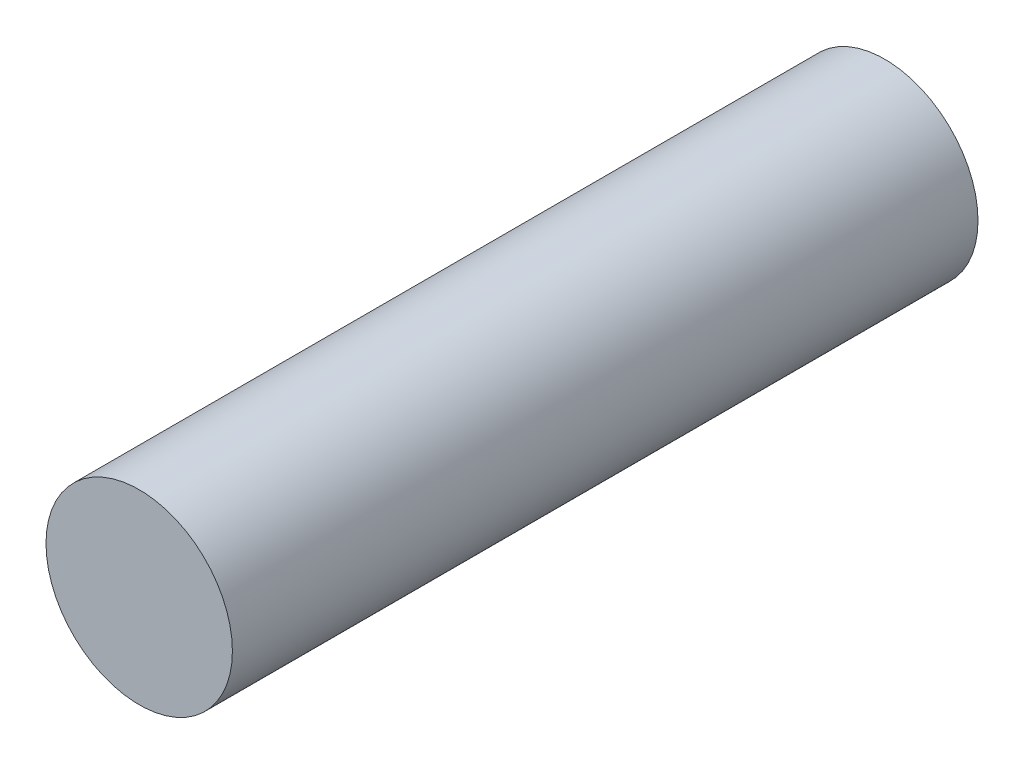
ISO-10303-21;
HEADER;
FILE_DESCRIPTION(('STEP AP214'),'2;1');
FILE_NAME('part.step','',(''),(''),'','','');
FILE_SCHEMA(('AUTOMOTIVE_DESIGN { 1 0 10303 214 1 1 1 1 }'));
ENDSEC;
DATA;
#1=APPLICATION_CONTEXT('core data for automotive mechanical design processes');
#2=APPLICATION_PROTOCOL_DEFINITION('international standard','automotive_design',2000,#1);
#3=PRODUCT_CONTEXT('',#1,'mechanical');
#4=PRODUCT('Part','Part','',(#3));
#5=PRODUCT_RELATED_PRODUCT_CATEGORY('part','',(#4));
#6=PRODUCT_DEFINITION_FORMATION('','',#4);
#7=PRODUCT_DEFINITION_CONTEXT('part definition',#1,'design');
#8=PRODUCT_DEFINITION('design','',#6,#7);
#9=PRODUCT_DEFINITION_SHAPE('','',#8);
#10=(LENGTH_UNIT() NAMED_UNIT(*) SI_UNIT(.MILLI.,.METRE.));
#11=(NAMED_UNIT(*) PLANE_ANGLE_UNIT() SI_UNIT($,.RADIAN.));
#12=(NAMED_UNIT(*) SI_UNIT($,.STERADIAN.) SOLID_ANGLE_UNIT());
#13=UNCERTAINTY_MEASURE_WITH_UNIT(LENGTH_MEASURE(1.E-05),#10,'distance_accuracy_value','');
#14=(GEOMETRIC_REPRESENTATION_CONTEXT(3) GLOBAL_UNCERTAINTY_ASSIGNED_CONTEXT((#13)) GLOBAL_UNIT_ASSIGNED_CONTEXT((#10,
#11,#12)) REPRESENTATION_CONTEXT('',''));
#15=CARTESIAN_POINT('',(0.,0.,0.));
#16=DIRECTION('',(0.,0.,1.));
#17=DIRECTION('',(1.,0.,0.));
#18=AXIS2_PLACEMENT_3D('',#15,#16,#17);
#19=CARTESIAN_POINT('',(0.,0.,19.05));
#20=DIRECTION('',(0.,0.,-1.));
#21=DIRECTION('',(-1.,0.,0.));
#22=AXIS2_PLACEMENT_3D('',#19,#20,#21);
#23=CYLINDRICAL_SURFACE('',#22,4.7625);
#24=CARTESIAN_POINT('',(0.,0.,19.05));
#25=DIRECTION('',(0.,0.,1.));
#26=DIRECTION('',(1.,0.,0.));
#27=AXIS2_PLACEMENT_3D('',#24,#25,#26);
#28=CIRCLE('',#27,4.7625);
#29=CARTESIAN_POINT('',(4.7625,0.,19.05));
#30=VERTEX_POINT('',#29);
#31=EDGE_CURVE('E10',#30,#30,#28,.T.);
#32=ORIENTED_EDGE('',*,*,#31,.F.);
#33=EDGE_LOOP('',(#32));
#34=FACE_BOUND('',#33,.T.);
#35=CARTESIAN_POINT('',(0.,0.,-19.05));
#36=DIRECTION('',(0.,0.,1.));
#37=DIRECTION('',(1.,0.,0.));
#38=AXIS2_PLACEMENT_3D('',#35,#36,#37);
#39=CIRCLE('',#38,4.7625);
#40=CARTESIAN_POINT('',(4.7625,0.,-19.05));
#41=VERTEX_POINT('',#40);
#42=EDGE_CURVE('E33',#41,#41,#39,.T.);
#43=ORIENTED_EDGE('',*,*,#42,.T.);
#44=EDGE_LOOP('',(#43));
#45=FACE_BOUND('',#44,.T.);
#46=ADVANCED_FACE('F30',(#34,#45),#23,.T.);
#47=CARTESIAN_POINT('',(0.,0.,19.05));
#48=DIRECTION('',(0.,0.,1.));
#49=DIRECTION('',(1.,0.,0.));
#50=AXIS2_PLACEMENT_3D('',#47,#48,#49);
#51=PLANE('',#50);
#52=ORIENTED_EDGE('',*,*,#31,.T.);
#53=EDGE_LOOP('',(#52));
#54=FACE_BOUND('',#53,.T.);
#55=ADVANCED_FACE('F45',(#54),#51,.T.);
#56=CARTESIAN_POINT('',(0.,0.,-19.05));
#57=DIRECTION('',(0.,0.,1.));
#58=DIRECTION('',(1.,0.,0.));
#59=AXIS2_PLACEMENT_3D('',#56,#57,#58);
#60=PLANE('',#59);
#61=ORIENTED_EDGE('',*,*,#42,.F.);
#62=EDGE_LOOP('',(#61));
#63=FACE_BOUND('',#62,.T.);
#64=ADVANCED_FACE('F43',(#63),#60,.F.);
#65=CLOSED_SHELL('',(#46,#55,#64));
#66=MANIFOLD_SOLID_BREP('B2',#65);
#67=ADVANCED_BREP_SHAPE_REPRESENTATION('',(#18,#66),#14);
#68=SHAPE_DEFINITION_REPRESENTATION(#9,#67);
ENDSEC;
END-ISO-10303-21;
